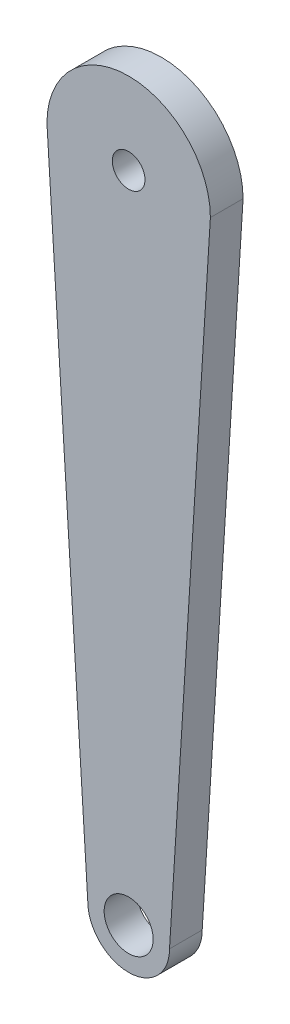
ISO-10303-21;
HEADER;
FILE_DESCRIPTION(('STEP AP214'),'2;1');
FILE_NAME('part.step','',(''),(''),'','','');
FILE_SCHEMA(('AUTOMOTIVE_DESIGN { 1 0 10303 214 1 1 1 1 }'));
ENDSEC;
DATA;
#1=APPLICATION_CONTEXT('core data for automotive mechanical design processes');
#2=APPLICATION_PROTOCOL_DEFINITION('international standard','automotive_design',2000,#1);
#3=PRODUCT_CONTEXT('',#1,'mechanical');
#4=PRODUCT('Part','Part','',(#3));
#5=PRODUCT_RELATED_PRODUCT_CATEGORY('part','',(#4));
#6=PRODUCT_DEFINITION_FORMATION('','',#4);
#7=PRODUCT_DEFINITION_CONTEXT('part definition',#1,'design');
#8=PRODUCT_DEFINITION('design','',#6,#7);
#9=PRODUCT_DEFINITION_SHAPE('','',#8);
#10=(LENGTH_UNIT() NAMED_UNIT(*) SI_UNIT(.MILLI.,.METRE.));
#11=(NAMED_UNIT(*) PLANE_ANGLE_UNIT() SI_UNIT($,.RADIAN.));
#12=(NAMED_UNIT(*) SI_UNIT($,.STERADIAN.) SOLID_ANGLE_UNIT());
#13=UNCERTAINTY_MEASURE_WITH_UNIT(LENGTH_MEASURE(1.E-05),#10,'distance_accuracy_value','');
#14=(GEOMETRIC_REPRESENTATION_CONTEXT(3) GLOBAL_UNCERTAINTY_ASSIGNED_CONTEXT((#13)) GLOBAL_UNIT_ASSIGNED_CONTEXT((#10,
#11,#12)) REPRESENTATION_CONTEXT('',''));
#15=CARTESIAN_POINT('',(0.,0.,0.));
#16=DIRECTION('',(0.,0.,1.));
#17=DIRECTION('',(1.,0.,0.));
#18=AXIS2_PLACEMENT_3D('',#15,#16,#17);
#19=CARTESIAN_POINT('',(-18.6770428015564,-1.16731517509728,10.));
#20=DIRECTION('',(0.998052578482888,0.0623782861551805,0.));
#21=DIRECTION('',(-0.0623782861551805,0.998052578482889,0.));
#22=AXIS2_PLACEMENT_3D('',#19,#20,#21);
#23=PLANE('',#22);
#24=DIRECTION('',(0.0623782861551805,-0.998052578482889,0.));
#25=VECTOR('',#24,1.);
#26=CARTESIAN_POINT('',(-18.6770428015564,-1.16731517509728,0.));
#27=LINE('',#26,#25);
#28=CARTESIAN_POINT('',(-25.,100.,0.));
#29=VERTEX_POINT('',#28);
#30=CARTESIAN_POINT('',(-12.5,-100.,0.));
#31=VERTEX_POINT('',#30);
#32=EDGE_CURVE('E115',#29,#31,#27,.T.);
#33=ORIENTED_EDGE('',*,*,#32,.T.);
#34=DIRECTION('',(0.,0.,-1.));
#35=VECTOR('',#34,1.);
#36=CARTESIAN_POINT('',(-12.5,-100.,10.));
#37=LINE('',#36,#35);
#38=CARTESIAN_POINT('',(-12.5,-100.,10.));
#39=VERTEX_POINT('',#38);
#40=EDGE_CURVE('E11',#39,#31,#37,.T.);
#41=ORIENTED_EDGE('',*,*,#40,.F.);
#42=DIRECTION('',(0.0623782861551805,-0.998052578482889,0.));
#43=VECTOR('',#42,1.);
#44=CARTESIAN_POINT('',(-18.6770428015564,-1.16731517509728,10.));
#45=LINE('',#44,#43);
#46=CARTESIAN_POINT('',(-25.,100.,10.));
#47=VERTEX_POINT('',#46);
#48=EDGE_CURVE('E95',#47,#39,#45,.T.);
#49=ORIENTED_EDGE('',*,*,#48,.F.);
#50=DIRECTION('',(0.,0.,-1.));
#51=VECTOR('',#50,1.);
#52=CARTESIAN_POINT('',(-25.,100.,10.));
#53=LINE('',#52,#51);
#54=EDGE_CURVE('E107',#47,#29,#53,.T.);
#55=ORIENTED_EDGE('',*,*,#54,.T.);
#56=EDGE_LOOP('',(#33,#41,#49,#55));
#57=FACE_BOUND('',#56,.T.);
#58=ADVANCED_FACE('F41',(#57),#23,.F.);
#59=CARTESIAN_POINT('',(0.,-100.,10.));
#60=DIRECTION('',(0.,0.,-1.));
#61=DIRECTION('',(-1.,0.,0.));
#62=AXIS2_PLACEMENT_3D('',#59,#60,#61);
#63=CYLINDRICAL_SURFACE('',#62,12.5);
#64=CARTESIAN_POINT('',(0.,-100.,0.));
#65=DIRECTION('',(0.,0.,1.));
#66=DIRECTION('',(1.,0.,0.));
#67=AXIS2_PLACEMENT_3D('',#64,#65,#66);
#68=CIRCLE('',#67,12.5);
#69=CARTESIAN_POINT('',(12.5,-100.,0.));
#70=VERTEX_POINT('',#69);
#71=EDGE_CURVE('E100',#31,#70,#68,.T.);
#72=ORIENTED_EDGE('',*,*,#71,.T.);
#73=DIRECTION('',(0.,0.,-1.));
#74=VECTOR('',#73,1.);
#75=CARTESIAN_POINT('',(12.5,-100.,10.));
#76=LINE('',#75,#74);
#77=CARTESIAN_POINT('',(12.5,-100.,10.));
#78=VERTEX_POINT('',#77);
#79=EDGE_CURVE('E51',#78,#70,#76,.T.);
#80=ORIENTED_EDGE('',*,*,#79,.F.);
#81=CARTESIAN_POINT('',(0.,-100.,10.));
#82=DIRECTION('',(0.,0.,1.));
#83=DIRECTION('',(1.,0.,0.));
#84=AXIS2_PLACEMENT_3D('',#81,#82,#83);
#85=CIRCLE('',#84,12.5);
#86=EDGE_CURVE('E89',#39,#78,#85,.T.);
#87=ORIENTED_EDGE('',*,*,#86,.F.);
#88=ORIENTED_EDGE('',*,*,#40,.T.);
#89=EDGE_LOOP('',(#72,#80,#87,#88));
#90=FACE_BOUND('',#89,.T.);
#91=ADVANCED_FACE('F99',(#90),#63,.T.);
#92=CARTESIAN_POINT('',(18.6770428015564,-1.16731517509728,10.));
#93=DIRECTION('',(-0.998052578482888,0.0623782861551805,0.));
#94=DIRECTION('',(-0.0623782861551805,-0.998052578482889,0.));
#95=AXIS2_PLACEMENT_3D('',#92,#93,#94);
#96=PLANE('',#95);
#97=DIRECTION('',(0.0623782861551805,0.998052578482889,0.));
#98=VECTOR('',#97,1.);
#99=CARTESIAN_POINT('',(18.6770428015564,-1.16731517509728,0.));
#100=LINE('',#99,#98);
#101=CARTESIAN_POINT('',(25.,100.,0.));
#102=VERTEX_POINT('',#101);
#103=EDGE_CURVE('E76',#70,#102,#100,.T.);
#104=ORIENTED_EDGE('',*,*,#103,.T.);
#105=DIRECTION('',(0.,0.,-1.));
#106=VECTOR('',#105,1.);
#107=CARTESIAN_POINT('',(25.,100.,10.));
#108=LINE('',#107,#106);
#109=CARTESIAN_POINT('',(25.,100.,10.));
#110=VERTEX_POINT('',#109);
#111=EDGE_CURVE('E102',#110,#102,#108,.T.);
#112=ORIENTED_EDGE('',*,*,#111,.F.);
#113=DIRECTION('',(0.0623782861551805,0.998052578482889,0.));
#114=VECTOR('',#113,1.);
#115=CARTESIAN_POINT('',(18.6770428015564,-1.16731517509728,10.));
#116=LINE('',#115,#114);
#117=EDGE_CURVE('E93',#78,#110,#116,.T.);
#118=ORIENTED_EDGE('',*,*,#117,.F.);
#119=ORIENTED_EDGE('',*,*,#79,.T.);
#120=EDGE_LOOP('',(#104,#112,#118,#119));
#121=FACE_BOUND('',#120,.T.);
#122=ADVANCED_FACE('F103',(#121),#96,.F.);
#123=CARTESIAN_POINT('',(0.,-100.,10.));
#124=DIRECTION('',(0.,0.,-1.));
#125=DIRECTION('',(-1.,0.,0.));
#126=AXIS2_PLACEMENT_3D('',#123,#124,#125);
#127=CYLINDRICAL_SURFACE('',#126,7.5);
#128=CARTESIAN_POINT('',(0.,-100.,10.));
#129=DIRECTION('',(0.,0.,1.));
#130=DIRECTION('',(1.,0.,0.));
#131=AXIS2_PLACEMENT_3D('',#128,#129,#130);
#132=CIRCLE('',#131,7.5);
#133=CARTESIAN_POINT('',(7.5,-100.,10.));
#134=VERTEX_POINT('',#133);
#135=EDGE_CURVE('E126',#134,#134,#132,.T.);
#136=ORIENTED_EDGE('',*,*,#135,.T.);
#137=EDGE_LOOP('',(#136));
#138=FACE_BOUND('',#137,.T.);
#139=CARTESIAN_POINT('',(0.,-100.,0.));
#140=DIRECTION('',(0.,0.,1.));
#141=DIRECTION('',(1.,0.,0.));
#142=AXIS2_PLACEMENT_3D('',#139,#140,#141);
#143=CIRCLE('',#142,7.5);
#144=CARTESIAN_POINT('',(7.5,-100.,0.));
#145=VERTEX_POINT('',#144);
#146=EDGE_CURVE('E111',#145,#145,#143,.T.);
#147=ORIENTED_EDGE('',*,*,#146,.F.);
#148=EDGE_LOOP('',(#147));
#149=FACE_BOUND('',#148,.T.);
#150=ADVANCED_FACE('F43',(#138,#149),#127,.F.);
#151=CARTESIAN_POINT('',(0.,100.,10.));
#152=DIRECTION('',(0.,0.,-1.));
#153=DIRECTION('',(-1.,0.,0.));
#154=AXIS2_PLACEMENT_3D('',#151,#152,#153);
#155=CYLINDRICAL_SURFACE('',#154,25.);
#156=CARTESIAN_POINT('',(0.,100.,0.));
#157=DIRECTION('',(0.,0.,1.));
#158=DIRECTION('',(1.,0.,0.));
#159=AXIS2_PLACEMENT_3D('',#156,#157,#158);
#160=CIRCLE('',#159,25.);
#161=EDGE_CURVE('E82',#102,#29,#160,.T.);
#162=ORIENTED_EDGE('',*,*,#161,.T.);
#163=ORIENTED_EDGE('',*,*,#54,.F.);
#164=CARTESIAN_POINT('',(0.,100.,10.));
#165=DIRECTION('',(0.,0.,1.));
#166=DIRECTION('',(1.,0.,0.));
#167=AXIS2_PLACEMENT_3D('',#164,#165,#166);
#168=CIRCLE('',#167,25.);
#169=EDGE_CURVE('E59',#110,#47,#168,.T.);
#170=ORIENTED_EDGE('',*,*,#169,.F.);
#171=ORIENTED_EDGE('',*,*,#111,.T.);
#172=EDGE_LOOP('',(#162,#163,#170,#171));
#173=FACE_BOUND('',#172,.T.);
#174=ADVANCED_FACE('F130',(#173),#155,.T.);
#175=CARTESIAN_POINT('',(0.,0.,10.));
#176=DIRECTION('',(0.,0.,1.));
#177=DIRECTION('',(1.,0.,0.));
#178=AXIS2_PLACEMENT_3D('',#175,#176,#177);
#179=PLANE('',#178);
#180=ORIENTED_EDGE('',*,*,#135,.F.);
#181=EDGE_LOOP('',(#180));
#182=FACE_BOUND('',#181,.T.);
#183=ORIENTED_EDGE('',*,*,#48,.T.);
#184=ORIENTED_EDGE('',*,*,#86,.T.);
#185=ORIENTED_EDGE('',*,*,#117,.T.);
#186=ORIENTED_EDGE('',*,*,#169,.T.);
#187=EDGE_LOOP('',(#183,#184,#185,#186));
#188=FACE_BOUND('',#187,.T.);
#189=CARTESIAN_POINT('',(0.,100.,10.));
#190=DIRECTION('',(0.,0.,1.));
#191=DIRECTION('',(1.,0.,0.));
#192=AXIS2_PLACEMENT_3D('',#189,#190,#191);
#193=CIRCLE('',#192,5.);
#194=CARTESIAN_POINT('',(5.,100.,10.));
#195=VERTEX_POINT('',#194);
#196=EDGE_CURVE('E144',#195,#195,#193,.T.);
#197=ORIENTED_EDGE('',*,*,#196,.F.);
#198=EDGE_LOOP('',(#197));
#199=FACE_BOUND('',#198,.T.);
#200=ADVANCED_FACE('F90',(#182,#188,#199),#179,.T.);
#201=CARTESIAN_POINT('',(0.,0.,0.));
#202=DIRECTION('',(0.,0.,1.));
#203=DIRECTION('',(1.,0.,0.));
#204=AXIS2_PLACEMENT_3D('',#201,#202,#203);
#205=PLANE('',#204);
#206=ORIENTED_EDGE('',*,*,#146,.T.);
#207=EDGE_LOOP('',(#206));
#208=FACE_BOUND('',#207,.T.);
#209=ORIENTED_EDGE('',*,*,#32,.F.);
#210=ORIENTED_EDGE('',*,*,#161,.F.);
#211=ORIENTED_EDGE('',*,*,#103,.F.);
#212=ORIENTED_EDGE('',*,*,#71,.F.);
#213=EDGE_LOOP('',(#209,#210,#211,#212));
#214=FACE_BOUND('',#213,.T.);
#215=CARTESIAN_POINT('',(0.,100.,0.));
#216=DIRECTION('',(0.,0.,1.));
#217=DIRECTION('',(1.,0.,0.));
#218=AXIS2_PLACEMENT_3D('',#215,#216,#217);
#219=CIRCLE('',#218,5.);
#220=CARTESIAN_POINT('',(5.,100.,0.));
#221=VERTEX_POINT('',#220);
#222=EDGE_CURVE('E116',#221,#221,#219,.F.);
#223=ORIENTED_EDGE('',*,*,#222,.F.);
#224=EDGE_LOOP('',(#223));
#225=FACE_BOUND('',#224,.T.);
#226=ADVANCED_FACE('F133',(#208,#214,#225),#205,.F.);
#227=CARTESIAN_POINT('',(0.,100.,-36.7695526217005));
#228=DIRECTION('',(0.,0.,1.));
#229=DIRECTION('',(1.,0.,0.));
#230=AXIS2_PLACEMENT_3D('',#227,#228,#229);
#231=CYLINDRICAL_SURFACE('',#230,5.);
#232=ORIENTED_EDGE('',*,*,#222,.T.);
#233=EDGE_LOOP('',(#232));
#234=FACE_BOUND('',#233,.T.);
#235=ORIENTED_EDGE('',*,*,#196,.T.);
#236=EDGE_LOOP('',(#235));
#237=FACE_BOUND('',#236,.T.);
#238=ADVANCED_FACE('F149',(#234,#237),#231,.F.);
#239=CLOSED_SHELL('',(#58,#91,#122,#150,#174,#200,#226,#238));
#240=MANIFOLD_SOLID_BREP('B2',#239);
#241=ADVANCED_BREP_SHAPE_REPRESENTATION('',(#18,#240),#14);
#242=SHAPE_DEFINITION_REPRESENTATION(#9,#241);
ENDSEC;
END-ISO-10303-21;
